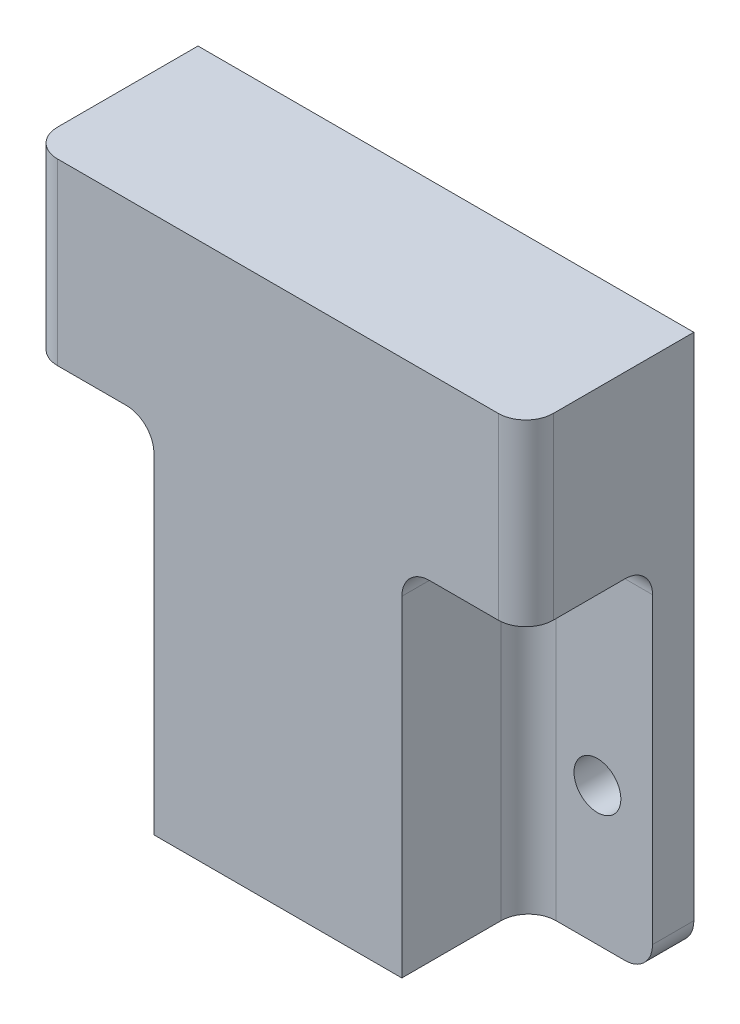
ISO-10303-21;
HEADER;
FILE_DESCRIPTION(('STEP AP214'),'2;1');
FILE_NAME('part.step','',(''),(''),'','','');
FILE_SCHEMA(('AUTOMOTIVE_DESIGN { 1 0 10303 214 1 1 1 1 }'));
ENDSEC;
DATA;
#1=APPLICATION_CONTEXT('core data for automotive mechanical design processes');
#2=APPLICATION_PROTOCOL_DEFINITION('international standard','automotive_design',2000,#1);
#3=PRODUCT_CONTEXT('',#1,'mechanical');
#4=PRODUCT('Part','Part','',(#3));
#5=PRODUCT_RELATED_PRODUCT_CATEGORY('part','',(#4));
#6=PRODUCT_DEFINITION_FORMATION('','',#4);
#7=PRODUCT_DEFINITION_CONTEXT('part definition',#1,'design');
#8=PRODUCT_DEFINITION('design','',#6,#7);
#9=PRODUCT_DEFINITION_SHAPE('','',#8);
#10=(LENGTH_UNIT() NAMED_UNIT(*) SI_UNIT(.MILLI.,.METRE.));
#11=(NAMED_UNIT(*) PLANE_ANGLE_UNIT() SI_UNIT($,.RADIAN.));
#12=(NAMED_UNIT(*) SI_UNIT($,.STERADIAN.) SOLID_ANGLE_UNIT());
#13=UNCERTAINTY_MEASURE_WITH_UNIT(LENGTH_MEASURE(1.E-05),#10,'distance_accuracy_value','');
#14=(GEOMETRIC_REPRESENTATION_CONTEXT(3) GLOBAL_UNCERTAINTY_ASSIGNED_CONTEXT((#13)) GLOBAL_UNIT_ASSIGNED_CONTEXT((#10,
#11,#12)) REPRESENTATION_CONTEXT('',''));
#15=CARTESIAN_POINT('',(0.,0.,0.));
#16=DIRECTION('',(0.,0.,1.));
#17=DIRECTION('',(1.,0.,0.));
#18=AXIS2_PLACEMENT_3D('',#15,#16,#17);
#19=CARTESIAN_POINT('',(0.,0.,3.));
#20=DIRECTION('',(0.,0.,1.));
#21=DIRECTION('',(1.,0.,0.));
#22=AXIS2_PLACEMENT_3D('',#19,#20,#21);
#23=PLANE('',#22);
#24=CARTESIAN_POINT('',(-14.,0.,3.));
#25=DIRECTION('',(0.,0.,1.));
#26=DIRECTION('',(1.,0.,0.));
#27=AXIS2_PLACEMENT_3D('',#24,#25,#26);
#28=CIRCLE('',#27,1.7);
#29=CARTESIAN_POINT('',(-12.3,0.,3.));
#30=VERTEX_POINT('',#29);
#31=EDGE_CURVE('E413',#30,#30,#28,.T.);
#32=ORIENTED_EDGE('',*,*,#31,.F.);
#33=EDGE_LOOP('',(#32));
#34=FACE_BOUND('',#33,.T.);
#35=DIRECTION('',(0.,-1.,0.));
#36=VECTOR('',#35,1.);
#37=CARTESIAN_POINT('',(-18.,0.,3.));
#38=LINE('',#37,#36);
#39=CARTESIAN_POINT('',(-18.,14.,3.));
#40=VERTEX_POINT('',#39);
#41=CARTESIAN_POINT('',(-18.,-8.,3.));
#42=VERTEX_POINT('',#41);
#43=EDGE_CURVE('E227',#40,#42,#38,.T.);
#44=ORIENTED_EDGE('',*,*,#43,.T.);
#45=CARTESIAN_POINT('',(-16.,-8.,3.));
#46=DIRECTION('',(0.,0.,1.));
#47=DIRECTION('',(1.,0.,0.));
#48=AXIS2_PLACEMENT_3D('',#45,#46,#47);
#49=CIRCLE('',#48,2.);
#50=CARTESIAN_POINT('',(-16.,-10.,3.));
#51=VERTEX_POINT('',#50);
#52=EDGE_CURVE('E11',#42,#51,#49,.T.);
#53=ORIENTED_EDGE('',*,*,#52,.T.);
#54=DIRECTION('',(-1.,0.,0.));
#55=VECTOR('',#54,1.);
#56=CARTESIAN_POINT('',(0.,-10.,3.));
#57=LINE('',#56,#55);
#58=CARTESIAN_POINT('',(-11.,-10.,3.));
#59=VERTEX_POINT('',#58);
#60=EDGE_CURVE('E391',#59,#51,#57,.T.);
#61=ORIENTED_EDGE('',*,*,#60,.F.);
#62=DIRECTION('',(0.,1.,0.));
#63=VECTOR('',#62,1.);
#64=CARTESIAN_POINT('',(-11.,16.,3.));
#65=LINE('',#64,#63);
#66=CARTESIAN_POINT('',(-11.,14.,3.));
#67=VERTEX_POINT('',#66);
#68=EDGE_CURVE('E436',#59,#67,#65,.T.);
#69=ORIENTED_EDGE('',*,*,#68,.T.);
#70=DIRECTION('',(1.,0.,0.));
#71=VECTOR('',#70,1.);
#72=CARTESIAN_POINT('',(0.,14.,3.));
#73=LINE('',#72,#71);
#74=EDGE_CURVE('E434',#67,#40,#73,.F.);
#75=ORIENTED_EDGE('',*,*,#74,.T.);
#76=EDGE_LOOP('',(#44,#53,#61,#69,#75));
#77=FACE_BOUND('',#76,.T.);
#78=ADVANCED_FACE('F43',(#34,#77),#23,.T.);
#79=CARTESIAN_POINT('',(6.5,-10.,3.));
#80=VERTEX_POINT('',#79);
#81=CARTESIAN_POINT('',(-6.5,-10.,3.));
#82=VERTEX_POINT('',#81);
#83=EDGE_CURVE('E387',#80,#82,#57,.T.);
#84=ORIENTED_EDGE('',*,*,#83,.F.);
#85=DIRECTION('',(0.,1.,0.));
#86=VECTOR('',#85,1.);
#87=CARTESIAN_POINT('',(6.5,-12.8701204345569,3.));
#88=LINE('',#87,#86);
#89=CARTESIAN_POINT('',(6.50000000000001,16.,3.));
#90=VERTEX_POINT('',#89);
#91=EDGE_CURVE('E279',#80,#90,#88,.T.);
#92=ORIENTED_EDGE('',*,*,#91,.T.);
#93=DIRECTION('',(1.,0.,0.));
#94=VECTOR('',#93,1.);
#95=CARTESIAN_POINT('',(-18.,16.,3.));
#96=LINE('',#95,#94);
#97=CARTESIAN_POINT('',(-6.50000000000001,16.,3.));
#98=VERTEX_POINT('',#97);
#99=EDGE_CURVE('E355',#98,#90,#96,.T.);
#100=ORIENTED_EDGE('',*,*,#99,.F.);
#101=DIRECTION('',(0.,1.,0.));
#102=VECTOR('',#101,1.);
#103=CARTESIAN_POINT('',(-6.5,-12.8701204345569,3.));
#104=LINE('',#103,#102);
#105=EDGE_CURVE('E393',#82,#98,#104,.T.);
#106=ORIENTED_EDGE('',*,*,#105,.F.);
#107=EDGE_LOOP('',(#84,#92,#100,#106));
#108=FACE_BOUND('',#107,.T.);
#109=ADVANCED_FACE('F515',(#108),#23,.T.);
#110=CARTESIAN_POINT('',(-6.5,-12.8701204345569,3.));
#111=DIRECTION('',(1.,0.,0.));
#112=DIRECTION('',(0.,0.,-1.));
#113=AXIS2_PLACEMENT_3D('',#110,#111,#112);
#114=PLANE('',#113);
#115=ORIENTED_EDGE('',*,*,#105,.T.);
#116=DIRECTION('',(0.,0.,1.));
#117=VECTOR('',#116,1.);
#118=CARTESIAN_POINT('',(-6.50000000000001,16.,3.));
#119=LINE('',#118,#117);
#120=CARTESIAN_POINT('',(-6.5,16.,9.));
#121=VERTEX_POINT('',#120);
#122=EDGE_CURVE('E366',#98,#121,#119,.T.);
#123=ORIENTED_EDGE('',*,*,#122,.T.);
#124=DIRECTION('',(0.,1.,0.));
#125=VECTOR('',#124,1.);
#126=CARTESIAN_POINT('',(-6.5,-12.8701204345569,9.));
#127=LINE('',#126,#125);
#128=CARTESIAN_POINT('',(-6.5,-10.,9.));
#129=VERTEX_POINT('',#128);
#130=EDGE_CURVE('E397',#129,#121,#127,.T.);
#131=ORIENTED_EDGE('',*,*,#130,.F.);
#132=DIRECTION('',(0.,0.,-1.));
#133=VECTOR('',#132,1.);
#134=CARTESIAN_POINT('',(-6.5,-10.,3.));
#135=LINE('',#134,#133);
#136=EDGE_CURVE('E376',#129,#82,#135,.T.);
#137=ORIENTED_EDGE('',*,*,#136,.T.);
#138=EDGE_LOOP('',(#115,#123,#131,#137));
#139=FACE_BOUND('',#138,.T.);
#140=ADVANCED_FACE('F521',(#139),#114,.T.);
#141=CARTESIAN_POINT('',(-6.5,-12.8701204345569,9.));
#142=DIRECTION('',(0.,0.,-1.));
#143=DIRECTION('',(-1.,0.,0.));
#144=AXIS2_PLACEMENT_3D('',#141,#142,#143);
#145=PLANE('',#144);
#146=ORIENTED_EDGE('',*,*,#130,.T.);
#147=DIRECTION('',(1.,0.,0.));
#148=VECTOR('',#147,1.);
#149=CARTESIAN_POINT('',(-6.5,16.,9.));
#150=LINE('',#149,#148);
#151=CARTESIAN_POINT('',(6.5,16.,9.));
#152=VERTEX_POINT('',#151);
#153=EDGE_CURVE('E361',#121,#152,#150,.T.);
#154=ORIENTED_EDGE('',*,*,#153,.T.);
#155=DIRECTION('',(0.,1.,0.));
#156=VECTOR('',#155,1.);
#157=CARTESIAN_POINT('',(6.5,-12.8701204345569,9.));
#158=LINE('',#157,#156);
#159=CARTESIAN_POINT('',(6.5,-10.,9.));
#160=VERTEX_POINT('',#159);
#161=EDGE_CURVE('E283',#160,#152,#158,.T.);
#162=ORIENTED_EDGE('',*,*,#161,.F.);
#163=DIRECTION('',(-1.,0.,0.));
#164=VECTOR('',#163,1.);
#165=CARTESIAN_POINT('',(-6.5,-10.,9.));
#166=LINE('',#165,#164);
#167=EDGE_CURVE('E373',#160,#129,#166,.T.);
#168=ORIENTED_EDGE('',*,*,#167,.T.);
#169=EDGE_LOOP('',(#146,#154,#162,#168));
#170=FACE_BOUND('',#169,.T.);
#171=ADVANCED_FACE('F564',(#170),#145,.T.);
#172=CARTESIAN_POINT('',(-9.,-12.8701204345569,12.2));
#173=DIRECTION('',(-1.,0.,0.));
#174=DIRECTION('',(0.,-1.,0.));
#175=AXIS2_PLACEMENT_3D('',#172,#173,#174);
#176=PLANE('',#175);
#177=DIRECTION('',(0.,1.,0.));
#178=VECTOR('',#177,1.);
#179=CARTESIAN_POINT('',(-9.,-12.8701204345569,12.2));
#180=LINE('',#179,#178);
#181=CARTESIAN_POINT('',(-9.,-10.,12.2));
#182=VERTEX_POINT('',#181);
#183=CARTESIAN_POINT('',(-9.,14.,12.2));
#184=VERTEX_POINT('',#183);
#185=EDGE_CURVE('E390',#182,#184,#180,.T.);
#186=ORIENTED_EDGE('',*,*,#185,.T.);
#187=DIRECTION('',(0.,0.,-1.));
#188=VECTOR('',#187,1.);
#189=CARTESIAN_POINT('',(-9.,14.,12.2));
#190=LINE('',#189,#188);
#191=CARTESIAN_POINT('',(-9.,14.,5.));
#192=VERTEX_POINT('',#191);
#193=EDGE_CURVE('E421',#184,#192,#190,.T.);
#194=ORIENTED_EDGE('',*,*,#193,.T.);
#195=DIRECTION('',(0.,1.,0.));
#196=VECTOR('',#195,1.);
#197=CARTESIAN_POINT('',(-9.,-10.,5.));
#198=LINE('',#197,#196);
#199=CARTESIAN_POINT('',(-9.,-10.,5.));
#200=VERTEX_POINT('',#199);
#201=EDGE_CURVE('E418',#192,#200,#198,.F.);
#202=ORIENTED_EDGE('',*,*,#201,.T.);
#203=DIRECTION('',(0.,0.,1.));
#204=VECTOR('',#203,1.);
#205=CARTESIAN_POINT('',(-9.,-10.,12.2));
#206=LINE('',#205,#204);
#207=EDGE_CURVE('E369',#200,#182,#206,.T.);
#208=ORIENTED_EDGE('',*,*,#207,.T.);
#209=EDGE_LOOP('',(#186,#194,#202,#208));
#210=FACE_BOUND('',#209,.T.);
#211=ADVANCED_FACE('F489',(#210),#176,.T.);
#212=CARTESIAN_POINT('',(0.,0.,0.));
#213=DIRECTION('',(0.,0.,1.));
#214=DIRECTION('',(1.,0.,0.));
#215=AXIS2_PLACEMENT_3D('',#212,#213,#214);
#216=PLANE('',#215);
#217=CARTESIAN_POINT('',(16.,-8.,0.));
#218=DIRECTION('',(0.,0.,-1.));
#219=DIRECTION('',(-1.,0.,0.));
#220=AXIS2_PLACEMENT_3D('',#217,#218,#219);
#221=CIRCLE('',#220,2.);
#222=CARTESIAN_POINT('',(16.,-10.,0.));
#223=VERTEX_POINT('',#222);
#224=CARTESIAN_POINT('',(18.,-8.,0.));
#225=VERTEX_POINT('',#224);
#226=EDGE_CURVE('E346',#223,#225,#221,.F.);
#227=ORIENTED_EDGE('',*,*,#226,.F.);
#228=DIRECTION('',(-1.,0.,0.));
#229=VECTOR('',#228,1.);
#230=CARTESIAN_POINT('',(0.,-10.,0.));
#231=LINE('',#230,#229);
#232=CARTESIAN_POINT('',(-16.,-10.,0.));
#233=VERTEX_POINT('',#232);
#234=EDGE_CURVE('E386',#223,#233,#231,.T.);
#235=ORIENTED_EDGE('',*,*,#234,.T.);
#236=CARTESIAN_POINT('',(-16.,-8.,0.));
#237=DIRECTION('',(0.,0.,1.));
#238=DIRECTION('',(1.,0.,0.));
#239=AXIS2_PLACEMENT_3D('',#236,#237,#238);
#240=CIRCLE('',#239,2.);
#241=CARTESIAN_POINT('',(-18.,-8.,0.));
#242=VERTEX_POINT('',#241);
#243=EDGE_CURVE('E65',#233,#242,#240,.F.);
#244=ORIENTED_EDGE('',*,*,#243,.T.);
#245=DIRECTION('',(0.,-1.,0.));
#246=VECTOR('',#245,1.);
#247=CARTESIAN_POINT('',(-18.,0.,0.));
#248=LINE('',#247,#246);
#249=CARTESIAN_POINT('',(-18.,29.,0.));
#250=VERTEX_POINT('',#249);
#251=EDGE_CURVE('E219',#250,#242,#248,.T.);
#252=ORIENTED_EDGE('',*,*,#251,.F.);
#253=DIRECTION('',(-1.,0.,0.));
#254=VECTOR('',#253,1.);
#255=CARTESIAN_POINT('',(18.,29.,0.));
#256=LINE('',#255,#254);
#257=CARTESIAN_POINT('',(18.,29.,0.));
#258=VERTEX_POINT('',#257);
#259=EDGE_CURVE('E226',#258,#250,#256,.T.);
#260=ORIENTED_EDGE('',*,*,#259,.F.);
#261=DIRECTION('',(0.,-1.,0.));
#262=VECTOR('',#261,1.);
#263=CARTESIAN_POINT('',(18.,0.,0.));
#264=LINE('',#263,#262);
#265=EDGE_CURVE('E302',#258,#225,#264,.T.);
#266=ORIENTED_EDGE('',*,*,#265,.T.);
#267=EDGE_LOOP('',(#227,#235,#244,#252,#260,#266));
#268=FACE_BOUND('',#267,.T.);
#269=CARTESIAN_POINT('',(-14.,0.,0.));
#270=DIRECTION('',(0.,0.,1.));
#271=DIRECTION('',(1.,0.,0.));
#272=AXIS2_PLACEMENT_3D('',#269,#270,#271);
#273=CIRCLE('',#272,1.7);
#274=CARTESIAN_POINT('',(-12.3,0.,0.));
#275=VERTEX_POINT('',#274);
#276=EDGE_CURVE('E228',#275,#275,#273,.T.);
#277=ORIENTED_EDGE('',*,*,#276,.T.);
#278=EDGE_LOOP('',(#277));
#279=FACE_BOUND('',#278,.T.);
#280=DIRECTION('',(1.,0.,0.));
#281=VECTOR('',#280,1.);
#282=CARTESIAN_POINT('',(0.,-3.,0.));
#283=LINE('',#282,#281);
#284=CARTESIAN_POINT('',(-8.,-3.,0.));
#285=VERTEX_POINT('',#284);
#286=CARTESIAN_POINT('',(8.,-3.,0.));
#287=VERTEX_POINT('',#286);
#288=EDGE_CURVE('E379',#285,#287,#283,.T.);
#289=ORIENTED_EDGE('',*,*,#288,.T.);
#290=DIRECTION('',(0.,1.,0.));
#291=VECTOR('',#290,1.);
#292=CARTESIAN_POINT('',(8.,0.,0.));
#293=LINE('',#292,#291);
#294=CARTESIAN_POINT('',(8.,3.,0.));
#295=VERTEX_POINT('',#294);
#296=EDGE_CURVE('E282',#287,#295,#293,.T.);
#297=ORIENTED_EDGE('',*,*,#296,.T.);
#298=DIRECTION('',(1.,0.,0.));
#299=VECTOR('',#298,1.);
#300=CARTESIAN_POINT('',(0.,3.,0.));
#301=LINE('',#300,#299);
#302=CARTESIAN_POINT('',(-8.,3.,0.));
#303=VERTEX_POINT('',#302);
#304=EDGE_CURVE('E405',#303,#295,#301,.T.);
#305=ORIENTED_EDGE('',*,*,#304,.F.);
#306=DIRECTION('',(0.,1.,0.));
#307=VECTOR('',#306,1.);
#308=CARTESIAN_POINT('',(-8.,0.,0.));
#309=LINE('',#308,#307);
#310=EDGE_CURVE('E396',#285,#303,#309,.T.);
#311=ORIENTED_EDGE('',*,*,#310,.F.);
#312=EDGE_LOOP('',(#289,#297,#305,#311));
#313=FACE_BOUND('',#312,.T.);
#314=CARTESIAN_POINT('',(14.,0.,0.));
#315=DIRECTION('',(0.,0.,-1.));
#316=DIRECTION('',(-1.,0.,0.));
#317=AXIS2_PLACEMENT_3D('',#314,#315,#316);
#318=CIRCLE('',#317,1.7);
#319=CARTESIAN_POINT('',(12.3,0.,0.));
#320=VERTEX_POINT('',#319);
#321=EDGE_CURVE('E299',#320,#320,#318,.T.);
#322=ORIENTED_EDGE('',*,*,#321,.F.);
#323=EDGE_LOOP('',(#322));
#324=FACE_BOUND('',#323,.T.);
#325=ADVANCED_FACE('F222',(#268,#279,#313,#324),#216,.F.);
#326=CARTESIAN_POINT('',(-18.,0.,3.));
#327=DIRECTION('',(1.,0.,0.));
#328=DIRECTION('',(0.,0.,-1.));
#329=AXIS2_PLACEMENT_3D('',#326,#327,#328);
#330=PLANE('',#329);
#331=ORIENTED_EDGE('',*,*,#251,.T.);
#332=DIRECTION('',(0.,0.,-1.));
#333=VECTOR('',#332,1.);
#334=CARTESIAN_POINT('',(-18.,-8.,3.));
#335=LINE('',#334,#333);
#336=EDGE_CURVE('E51',#242,#42,#335,.F.);
#337=ORIENTED_EDGE('',*,*,#336,.T.);
#338=ORIENTED_EDGE('',*,*,#43,.F.);
#339=CARTESIAN_POINT('',(-18.,14.,5.));
#340=DIRECTION('',(1.,0.,0.));
#341=DIRECTION('',(0.,0.,-1.));
#342=AXIS2_PLACEMENT_3D('',#339,#340,#341);
#343=CIRCLE('',#342,2.);
#344=CARTESIAN_POINT('',(-18.,16.,5.));
#345=VERTEX_POINT('',#344);
#346=EDGE_CURVE('E442',#40,#345,#343,.T.);
#347=ORIENTED_EDGE('',*,*,#346,.T.);
#348=DIRECTION('',(0.,0.,-1.));
#349=VECTOR('',#348,1.);
#350=CARTESIAN_POINT('',(-18.,16.,30.4482875908947));
#351=LINE('',#350,#349);
#352=CARTESIAN_POINT('',(-18.,16.,10.2));
#353=VERTEX_POINT('',#352);
#354=EDGE_CURVE('E358',#353,#345,#351,.T.);
#355=ORIENTED_EDGE('',*,*,#354,.F.);
#356=DIRECTION('',(0.,-1.,0.));
#357=VECTOR('',#356,1.);
#358=CARTESIAN_POINT('',(-18.,19.,10.2));
#359=LINE('',#358,#357);
#360=CARTESIAN_POINT('',(-18.,29.,10.2));
#361=VERTEX_POINT('',#360);
#362=EDGE_CURVE('E235',#353,#361,#359,.F.);
#363=ORIENTED_EDGE('',*,*,#362,.T.);
#364=DIRECTION('',(0.,0.,1.));
#365=VECTOR('',#364,1.);
#366=CARTESIAN_POINT('',(-18.,29.,0.));
#367=LINE('',#366,#365);
#368=EDGE_CURVE('E231',#250,#361,#367,.T.);
#369=ORIENTED_EDGE('',*,*,#368,.F.);
#370=EDGE_LOOP('',(#331,#337,#338,#347,#355,#363,#369));
#371=FACE_BOUND('',#370,.T.);
#372=ADVANCED_FACE('F232',(#371),#330,.F.);
#373=CARTESIAN_POINT('',(-14.,0.,3.));
#374=DIRECTION('',(0.,0.,1.));
#375=DIRECTION('',(1.,0.,0.));
#376=AXIS2_PLACEMENT_3D('',#373,#374,#375);
#377=CYLINDRICAL_SURFACE('',#376,1.7);
#378=ORIENTED_EDGE('',*,*,#31,.T.);
#379=EDGE_LOOP('',(#378));
#380=FACE_BOUND('',#379,.T.);
#381=ORIENTED_EDGE('',*,*,#276,.F.);
#382=EDGE_LOOP('',(#381));
#383=FACE_BOUND('',#382,.T.);
#384=ADVANCED_FACE('F526',(#380,#383),#377,.F.);
#385=CARTESIAN_POINT('',(-8.,0.,-3.));
#386=DIRECTION('',(1.,0.,0.));
#387=DIRECTION('',(0.,0.,-1.));
#388=AXIS2_PLACEMENT_3D('',#385,#386,#387);
#389=PLANE('',#388);
#390=ORIENTED_EDGE('',*,*,#310,.T.);
#391=DIRECTION('',(0.,0.,1.));
#392=VECTOR('',#391,1.);
#393=CARTESIAN_POINT('',(-8.,3.,-3.));
#394=LINE('',#393,#392);
#395=CARTESIAN_POINT('',(-8.,3.,-3.));
#396=VERTEX_POINT('',#395);
#397=EDGE_CURVE('E407',#396,#303,#394,.T.);
#398=ORIENTED_EDGE('',*,*,#397,.F.);
#399=DIRECTION('',(0.,1.,0.));
#400=VECTOR('',#399,1.);
#401=CARTESIAN_POINT('',(-8.,0.,-3.));
#402=LINE('',#401,#400);
#403=CARTESIAN_POINT('',(-8.,-3.,-3.));
#404=VERTEX_POINT('',#403);
#405=EDGE_CURVE('E402',#404,#396,#402,.T.);
#406=ORIENTED_EDGE('',*,*,#405,.F.);
#407=DIRECTION('',(0.,0.,1.));
#408=VECTOR('',#407,1.);
#409=CARTESIAN_POINT('',(-8.,-3.,-3.));
#410=LINE('',#409,#408);
#411=EDGE_CURVE('E382',#404,#285,#410,.T.);
#412=ORIENTED_EDGE('',*,*,#411,.T.);
#413=EDGE_LOOP('',(#390,#398,#406,#412));
#414=FACE_BOUND('',#413,.T.);
#415=ADVANCED_FACE('F579',(#414),#389,.F.);
#416=CARTESIAN_POINT('',(0.,3.,-3.));
#417=DIRECTION('',(0.,-1.,0.));
#418=DIRECTION('',(0.,0.,-1.));
#419=AXIS2_PLACEMENT_3D('',#416,#417,#418);
#420=PLANE('',#419);
#421=ORIENTED_EDGE('',*,*,#304,.T.);
#422=DIRECTION('',(0.,0.,1.));
#423=VECTOR('',#422,1.);
#424=CARTESIAN_POINT('',(8.,3.,-3.));
#425=LINE('',#424,#423);
#426=CARTESIAN_POINT('',(8.,3.,-3.));
#427=VERTEX_POINT('',#426);
#428=EDGE_CURVE('E291',#427,#295,#425,.T.);
#429=ORIENTED_EDGE('',*,*,#428,.F.);
#430=DIRECTION('',(1.,0.,0.));
#431=VECTOR('',#430,1.);
#432=CARTESIAN_POINT('',(0.,3.,-3.));
#433=LINE('',#432,#431);
#434=EDGE_CURVE('E404',#396,#427,#433,.T.);
#435=ORIENTED_EDGE('',*,*,#434,.F.);
#436=ORIENTED_EDGE('',*,*,#397,.T.);
#437=EDGE_LOOP('',(#421,#429,#435,#436));
#438=FACE_BOUND('',#437,.T.);
#439=ADVANCED_FACE('F576',(#438),#420,.F.);
#440=CARTESIAN_POINT('',(0.,0.,-3.));
#441=DIRECTION('',(0.,0.,1.));
#442=DIRECTION('',(1.,0.,0.));
#443=AXIS2_PLACEMENT_3D('',#440,#441,#442);
#444=PLANE('',#443);
#445=ORIENTED_EDGE('',*,*,#434,.T.);
#446=DIRECTION('',(0.,1.,0.));
#447=VECTOR('',#446,1.);
#448=CARTESIAN_POINT('',(8.,0.,-3.));
#449=LINE('',#448,#447);
#450=CARTESIAN_POINT('',(8.,-3.,-3.));
#451=VERTEX_POINT('',#450);
#452=EDGE_CURVE('E288',#451,#427,#449,.T.);
#453=ORIENTED_EDGE('',*,*,#452,.F.);
#454=DIRECTION('',(1.,0.,0.));
#455=VECTOR('',#454,1.);
#456=CARTESIAN_POINT('',(0.,-3.,-3.));
#457=LINE('',#456,#455);
#458=EDGE_CURVE('E380',#404,#451,#457,.T.);
#459=ORIENTED_EDGE('',*,*,#458,.F.);
#460=ORIENTED_EDGE('',*,*,#405,.T.);
#461=EDGE_LOOP('',(#445,#453,#459,#460));
#462=FACE_BOUND('',#461,.T.);
#463=ADVANCED_FACE('F571',(#462),#444,.F.);
#464=CARTESIAN_POINT('',(0.,-12.8701204345569,12.2));
#465=DIRECTION('',(0.,0.,1.));
#466=DIRECTION('',(1.,0.,0.));
#467=AXIS2_PLACEMENT_3D('',#464,#465,#466);
#468=PLANE('',#467);
#469=DIRECTION('',(0.,-1.,0.));
#470=VECTOR('',#469,1.);
#471=CARTESIAN_POINT('',(16.,16.,12.2));
#472=LINE('',#471,#470);
#473=CARTESIAN_POINT('',(16.,29.,12.2));
#474=VERTEX_POINT('',#473);
#475=CARTESIAN_POINT('',(16.,16.,12.2));
#476=VERTEX_POINT('',#475);
#477=EDGE_CURVE('E320',#474,#476,#472,.T.);
#478=ORIENTED_EDGE('',*,*,#477,.F.);
#479=DIRECTION('',(1.,0.,0.));
#480=VECTOR('',#479,1.);
#481=CARTESIAN_POINT('',(-16.,29.,12.2));
#482=LINE('',#481,#480);
#483=CARTESIAN_POINT('',(-16.,29.,12.2));
#484=VERTEX_POINT('',#483);
#485=EDGE_CURVE('E249',#484,#474,#482,.T.);
#486=ORIENTED_EDGE('',*,*,#485,.F.);
#487=DIRECTION('',(0.,-1.,0.));
#488=VECTOR('',#487,1.);
#489=CARTESIAN_POINT('',(-16.,16.,12.2));
#490=LINE('',#489,#488);
#491=CARTESIAN_POINT('',(-16.,16.,12.2));
#492=VERTEX_POINT('',#491);
#493=EDGE_CURVE('E430',#484,#492,#490,.T.);
#494=ORIENTED_EDGE('',*,*,#493,.T.);
#495=DIRECTION('',(1.,0.,0.));
#496=VECTOR('',#495,1.);
#497=CARTESIAN_POINT('',(-18.,16.,12.2));
#498=LINE('',#497,#496);
#499=CARTESIAN_POINT('',(-11.,16.,12.2));
#500=VERTEX_POINT('',#499);
#501=EDGE_CURVE('E357',#492,#500,#498,.T.);
#502=ORIENTED_EDGE('',*,*,#501,.T.);
#503=CARTESIAN_POINT('',(-11.,14.,12.2));
#504=DIRECTION('',(0.,0.,1.));
#505=DIRECTION('',(1.,0.,0.));
#506=AXIS2_PLACEMENT_3D('',#503,#504,#505);
#507=CIRCLE('',#506,2.);
#508=EDGE_CURVE('E438',#500,#184,#507,.F.);
#509=ORIENTED_EDGE('',*,*,#508,.T.);
#510=ORIENTED_EDGE('',*,*,#185,.F.);
#511=DIRECTION('',(1.,0.,0.));
#512=VECTOR('',#511,1.);
#513=CARTESIAN_POINT('',(0.,-10.,12.2));
#514=LINE('',#513,#512);
#515=CARTESIAN_POINT('',(9.,-10.,12.2));
#516=VERTEX_POINT('',#515);
#517=EDGE_CURVE('E371',#182,#516,#514,.T.);
#518=ORIENTED_EDGE('',*,*,#517,.T.);
#519=DIRECTION('',(0.,1.,0.));
#520=VECTOR('',#519,1.);
#521=CARTESIAN_POINT('',(9.,-12.8701204345569,12.2));
#522=LINE('',#521,#520);
#523=CARTESIAN_POINT('',(9.,14.,12.2));
#524=VERTEX_POINT('',#523);
#525=EDGE_CURVE('E278',#516,#524,#522,.T.);
#526=ORIENTED_EDGE('',*,*,#525,.T.);
#527=CARTESIAN_POINT('',(11.,14.,12.2));
#528=DIRECTION('',(0.,0.,-1.));
#529=DIRECTION('',(-1.,0.,0.));
#530=AXIS2_PLACEMENT_3D('',#527,#528,#529);
#531=CIRCLE('',#530,2.);
#532=CARTESIAN_POINT('',(11.,16.,12.2));
#533=VERTEX_POINT('',#532);
#534=EDGE_CURVE('E331',#533,#524,#531,.F.);
#535=ORIENTED_EDGE('',*,*,#534,.F.);
#536=DIRECTION('',(-1.,0.,0.));
#537=VECTOR('',#536,1.);
#538=CARTESIAN_POINT('',(18.,16.,12.2));
#539=LINE('',#538,#537);
#540=EDGE_CURVE('E256',#476,#533,#539,.T.);
#541=ORIENTED_EDGE('',*,*,#540,.F.);
#542=EDGE_LOOP('',(#478,#486,#494,#502,#509,#510,#518,#526,#535,#541));
#543=FACE_BOUND('',#542,.T.);
#544=ADVANCED_FACE('F484',(#543),#468,.T.);
#545=CARTESIAN_POINT('',(0.,-10.,3.));
#546=DIRECTION('',(0.,1.,0.));
#547=DIRECTION('',(0.,0.,-1.));
#548=AXIS2_PLACEMENT_3D('',#545,#546,#547);
#549=PLANE('',#548);
#550=ORIENTED_EDGE('',*,*,#234,.F.);
#551=DIRECTION('',(0.,0.,-1.));
#552=VECTOR('',#551,1.);
#553=CARTESIAN_POINT('',(16.,-10.,3.));
#554=LINE('',#553,#552);
#555=CARTESIAN_POINT('',(16.,-10.,3.));
#556=VERTEX_POINT('',#555);
#557=EDGE_CURVE('E338',#556,#223,#554,.T.);
#558=ORIENTED_EDGE('',*,*,#557,.F.);
#559=DIRECTION('',(1.,0.,0.));
#560=VECTOR('',#559,1.);
#561=CARTESIAN_POINT('',(0.,-10.,3.));
#562=LINE('',#561,#560);
#563=CARTESIAN_POINT('',(11.,-10.,3.));
#564=VERTEX_POINT('',#563);
#565=EDGE_CURVE('E275',#564,#556,#562,.T.);
#566=ORIENTED_EDGE('',*,*,#565,.F.);
#567=CARTESIAN_POINT('',(11.,-10.,5.));
#568=DIRECTION('',(0.,-1.,0.));
#569=DIRECTION('',(1.,0.,0.));
#570=AXIS2_PLACEMENT_3D('',#567,#568,#569);
#571=CIRCLE('',#570,2.);
#572=CARTESIAN_POINT('',(9.,-10.,5.));
#573=VERTEX_POINT('',#572);
#574=EDGE_CURVE('E333',#573,#564,#571,.T.);
#575=ORIENTED_EDGE('',*,*,#574,.F.);
#576=DIRECTION('',(0.,0.,1.));
#577=VECTOR('',#576,1.);
#578=CARTESIAN_POINT('',(9.,-10.,12.2));
#579=LINE('',#578,#577);
#580=EDGE_CURVE('E266',#573,#516,#579,.T.);
#581=ORIENTED_EDGE('',*,*,#580,.T.);
#582=ORIENTED_EDGE('',*,*,#517,.F.);
#583=ORIENTED_EDGE('',*,*,#207,.F.);
#584=CARTESIAN_POINT('',(-11.,-10.,5.));
#585=DIRECTION('',(0.,1.,0.));
#586=DIRECTION('',(-1.,0.,0.));
#587=AXIS2_PLACEMENT_3D('',#584,#585,#586);
#588=CIRCLE('',#587,2.);
#589=EDGE_CURVE('E440',#200,#59,#588,.T.);
#590=ORIENTED_EDGE('',*,*,#589,.T.);
#591=ORIENTED_EDGE('',*,*,#60,.T.);
#592=DIRECTION('',(0.,0.,-1.));
#593=VECTOR('',#592,1.);
#594=CARTESIAN_POINT('',(-16.,-10.,3.));
#595=LINE('',#594,#593);
#596=EDGE_CURVE('E444',#51,#233,#595,.T.);
#597=ORIENTED_EDGE('',*,*,#596,.T.);
#598=EDGE_LOOP('',(#550,#558,#566,#575,#581,#582,#583,#590,#591,#597));
#599=FACE_BOUND('',#598,.T.);
#600=DIRECTION('',(0.,0.,-1.));
#601=VECTOR('',#600,1.);
#602=CARTESIAN_POINT('',(6.5,-10.,3.));
#603=LINE('',#602,#601);
#604=EDGE_CURVE('E269',#160,#80,#603,.T.);
#605=ORIENTED_EDGE('',*,*,#604,.T.);
#606=ORIENTED_EDGE('',*,*,#83,.T.);
#607=ORIENTED_EDGE('',*,*,#136,.F.);
#608=ORIENTED_EDGE('',*,*,#167,.F.);
#609=EDGE_LOOP('',(#605,#606,#607,#608));
#610=FACE_BOUND('',#609,.T.);
#611=ADVANCED_FACE('F456',(#599,#610),#549,.F.);
#612=CARTESIAN_POINT('',(0.,-3.,-3.));
#613=DIRECTION('',(0.,1.,0.));
#614=DIRECTION('',(0.,0.,-1.));
#615=AXIS2_PLACEMENT_3D('',#612,#613,#614);
#616=PLANE('',#615);
#617=ORIENTED_EDGE('',*,*,#288,.F.);
#618=ORIENTED_EDGE('',*,*,#411,.F.);
#619=ORIENTED_EDGE('',*,*,#458,.T.);
#620=DIRECTION('',(0.,0.,1.));
#621=VECTOR('',#620,1.);
#622=CARTESIAN_POINT('',(8.,-3.,-3.));
#623=LINE('',#622,#621);
#624=EDGE_CURVE('E272',#451,#287,#623,.T.);
#625=ORIENTED_EDGE('',*,*,#624,.T.);
#626=EDGE_LOOP('',(#617,#618,#619,#625));
#627=FACE_BOUND('',#626,.T.);
#628=ADVANCED_FACE('F551',(#627),#616,.F.);
#629=CARTESIAN_POINT('',(-18.,16.,30.4482875908947));
#630=DIRECTION('',(0.,1.,0.));
#631=DIRECTION('',(-1.,0.,0.));
#632=AXIS2_PLACEMENT_3D('',#629,#630,#631);
#633=PLANE('',#632);
#634=ORIENTED_EDGE('',*,*,#122,.F.);
#635=ORIENTED_EDGE('',*,*,#99,.T.);
#636=DIRECTION('',(0.,0.,1.));
#637=VECTOR('',#636,1.);
#638=CARTESIAN_POINT('',(6.50000000000001,16.,3.));
#639=LINE('',#638,#637);
#640=EDGE_CURVE('E259',#90,#152,#639,.T.);
#641=ORIENTED_EDGE('',*,*,#640,.T.);
#642=ORIENTED_EDGE('',*,*,#153,.F.);
#643=EDGE_LOOP('',(#634,#635,#641,#642));
#644=FACE_BOUND('',#643,.T.);
#645=ADVANCED_FACE('F545',(#644),#633,.F.);
#646=ORIENTED_EDGE('',*,*,#501,.F.);
#647=CARTESIAN_POINT('',(-16.,16.,10.2));
#648=DIRECTION('',(0.,1.,0.));
#649=DIRECTION('',(-1.,0.,0.));
#650=AXIS2_PLACEMENT_3D('',#647,#648,#649);
#651=CIRCLE('',#650,2.);
#652=EDGE_CURVE('E428',#492,#353,#651,.F.);
#653=ORIENTED_EDGE('',*,*,#652,.T.);
#654=ORIENTED_EDGE('',*,*,#354,.T.);
#655=DIRECTION('',(1.,0.,0.));
#656=VECTOR('',#655,1.);
#657=CARTESIAN_POINT('',(-18.,16.,5.));
#658=LINE('',#657,#656);
#659=CARTESIAN_POINT('',(-11.,16.,5.));
#660=VERTEX_POINT('',#659);
#661=EDGE_CURVE('E424',#345,#660,#658,.T.);
#662=ORIENTED_EDGE('',*,*,#661,.T.);
#663=DIRECTION('',(0.,0.,-1.));
#664=VECTOR('',#663,1.);
#665=CARTESIAN_POINT('',(-11.,16.,30.4482875908947));
#666=LINE('',#665,#664);
#667=EDGE_CURVE('E426',#660,#500,#666,.F.);
#668=ORIENTED_EDGE('',*,*,#667,.T.);
#669=EDGE_LOOP('',(#646,#653,#654,#662,#668));
#670=FACE_BOUND('',#669,.T.);
#671=ADVANCED_FACE('F541',(#670),#633,.F.);
#672=CARTESIAN_POINT('',(-11.,0.,5.));
#673=DIRECTION('',(0.,-1.,0.));
#674=DIRECTION('',(1.,0.,0.));
#675=AXIS2_PLACEMENT_3D('',#672,#673,#674);
#676=CYLINDRICAL_SURFACE('',#675,2.);
#677=ORIENTED_EDGE('',*,*,#589,.F.);
#678=ORIENTED_EDGE('',*,*,#201,.F.);
#679=CARTESIAN_POINT('',(-11.,14.,5.));
#680=DIRECTION('',(0.,-1.,0.));
#681=DIRECTION('',(0.,0.,-1.));
#682=AXIS2_PLACEMENT_3D('',#679,#680,#681);
#683=CIRCLE('',#682,2.);
#684=EDGE_CURVE('E364',#67,#192,#683,.T.);
#685=ORIENTED_EDGE('',*,*,#684,.F.);
#686=ORIENTED_EDGE('',*,*,#68,.F.);
#687=EDGE_LOOP('',(#677,#678,#685,#686));
#688=FACE_BOUND('',#687,.T.);
#689=ADVANCED_FACE('F501',(#688),#676,.F.);
#690=CARTESIAN_POINT('',(-18.,14.,5.));
#691=DIRECTION('',(1.,0.,0.));
#692=DIRECTION('',(0.,1.,0.));
#693=AXIS2_PLACEMENT_3D('',#690,#691,#692);
#694=CYLINDRICAL_SURFACE('',#693,2.);
#695=ORIENTED_EDGE('',*,*,#346,.F.);
#696=ORIENTED_EDGE('',*,*,#74,.F.);
#697=CARTESIAN_POINT('',(-11.,14.,5.));
#698=DIRECTION('',(-1.,0.,0.));
#699=DIRECTION('',(0.,0.,1.));
#700=AXIS2_PLACEMENT_3D('',#697,#698,#699);
#701=CIRCLE('',#700,2.);
#702=EDGE_CURVE('E446',#660,#67,#701,.T.);
#703=ORIENTED_EDGE('',*,*,#702,.F.);
#704=ORIENTED_EDGE('',*,*,#661,.F.);
#705=EDGE_LOOP('',(#695,#696,#703,#704));
#706=FACE_BOUND('',#705,.T.);
#707=ADVANCED_FACE('F536',(#706),#694,.F.);
#708=CARTESIAN_POINT('',(-11.,14.,5.));
#709=DIRECTION('',(0.,0.,1.));
#710=DIRECTION('',(1.,0.,0.));
#711=AXIS2_PLACEMENT_3D('',#708,#709,#710);
#712=SPHERICAL_SURFACE('',#711,2.);
#713=ORIENTED_EDGE('',*,*,#702,.T.);
#714=ORIENTED_EDGE('',*,*,#684,.T.);
#715=CARTESIAN_POINT('',(-11.,14.,5.));
#716=DIRECTION('',(0.,0.,1.));
#717=DIRECTION('',(0.,-1.,0.));
#718=AXIS2_PLACEMENT_3D('',#715,#716,#717);
#719=CIRCLE('',#718,2.);
#720=EDGE_CURVE('E354',#660,#192,#719,.F.);
#721=ORIENTED_EDGE('',*,*,#720,.F.);
#722=EDGE_LOOP('',(#713,#714,#721));
#723=FACE_BOUND('',#722,.T.);
#724=ADVANCED_FACE('F497',(#723),#712,.F.);
#725=CARTESIAN_POINT('',(-11.,14.,12.2));
#726=DIRECTION('',(0.,0.,-1.));
#727=DIRECTION('',(-1.,0.,0.));
#728=AXIS2_PLACEMENT_3D('',#725,#726,#727);
#729=CYLINDRICAL_SURFACE('',#728,2.);
#730=ORIENTED_EDGE('',*,*,#508,.F.);
#731=ORIENTED_EDGE('',*,*,#667,.F.);
#732=ORIENTED_EDGE('',*,*,#720,.T.);
#733=ORIENTED_EDGE('',*,*,#193,.F.);
#734=EDGE_LOOP('',(#730,#731,#732,#733));
#735=FACE_BOUND('',#734,.T.);
#736=ADVANCED_FACE('F491',(#735),#729,.F.);
#737=CARTESIAN_POINT('',(-16.,-12.8701204345569,10.2));
#738=DIRECTION('',(0.,1.,0.));
#739=DIRECTION('',(0.,0.,1.));
#740=AXIS2_PLACEMENT_3D('',#737,#738,#739);
#741=CYLINDRICAL_SURFACE('',#740,2.);
#742=ORIENTED_EDGE('',*,*,#493,.F.);
#743=CARTESIAN_POINT('',(-16.,29.,10.2));
#744=DIRECTION('',(0.,1.,0.));
#745=DIRECTION('',(0.,0.,1.));
#746=AXIS2_PLACEMENT_3D('',#743,#744,#745);
#747=CIRCLE('',#746,2.);
#748=EDGE_CURVE('E239',#361,#484,#747,.T.);
#749=ORIENTED_EDGE('',*,*,#748,.F.);
#750=ORIENTED_EDGE('',*,*,#362,.F.);
#751=ORIENTED_EDGE('',*,*,#652,.F.);
#752=EDGE_LOOP('',(#742,#749,#750,#751));
#753=FACE_BOUND('',#752,.T.);
#754=ADVANCED_FACE('F505',(#753),#741,.T.);
#755=CARTESIAN_POINT('',(-16.,-8.,3.));
#756=DIRECTION('',(0.,0.,-1.));
#757=DIRECTION('',(-1.,0.,0.));
#758=AXIS2_PLACEMENT_3D('',#755,#756,#757);
#759=CYLINDRICAL_SURFACE('',#758,2.);
#760=ORIENTED_EDGE('',*,*,#52,.F.);
#761=ORIENTED_EDGE('',*,*,#336,.F.);
#762=ORIENTED_EDGE('',*,*,#243,.F.);
#763=ORIENTED_EDGE('',*,*,#596,.F.);
#764=EDGE_LOOP('',(#760,#761,#762,#763));
#765=FACE_BOUND('',#764,.T.);
#766=ADVANCED_FACE('F45',(#765),#759,.T.);
#767=CARTESIAN_POINT('',(0.,0.,3.));
#768=DIRECTION('',(0.,0.,1.));
#769=DIRECTION('',(-1.,0.,0.));
#770=AXIS2_PLACEMENT_3D('',#767,#768,#769);
#771=PLANE('',#770);
#772=CARTESIAN_POINT('',(14.,0.,3.));
#773=DIRECTION('',(0.,0.,-1.));
#774=DIRECTION('',(-1.,0.,0.));
#775=AXIS2_PLACEMENT_3D('',#772,#773,#774);
#776=CIRCLE('',#775,1.7);
#777=CARTESIAN_POINT('',(12.3,0.,3.));
#778=VERTEX_POINT('',#777);
#779=EDGE_CURVE('E296',#778,#778,#776,.T.);
#780=ORIENTED_EDGE('',*,*,#779,.T.);
#781=EDGE_LOOP('',(#780));
#782=FACE_BOUND('',#781,.T.);
#783=DIRECTION('',(0.,-1.,0.));
#784=VECTOR('',#783,1.);
#785=CARTESIAN_POINT('',(18.,0.,3.));
#786=LINE('',#785,#784);
#787=CARTESIAN_POINT('',(18.,14.,3.));
#788=VERTEX_POINT('',#787);
#789=CARTESIAN_POINT('',(18.,-8.,3.));
#790=VERTEX_POINT('',#789);
#791=EDGE_CURVE('E303',#788,#790,#786,.T.);
#792=ORIENTED_EDGE('',*,*,#791,.F.);
#793=DIRECTION('',(-1.,0.,0.));
#794=VECTOR('',#793,1.);
#795=CARTESIAN_POINT('',(0.,14.,3.));
#796=LINE('',#795,#794);
#797=CARTESIAN_POINT('',(11.,14.,3.));
#798=VERTEX_POINT('',#797);
#799=EDGE_CURVE('E325',#798,#788,#796,.F.);
#800=ORIENTED_EDGE('',*,*,#799,.F.);
#801=DIRECTION('',(0.,1.,0.));
#802=VECTOR('',#801,1.);
#803=CARTESIAN_POINT('',(11.,16.,3.));
#804=LINE('',#803,#802);
#805=EDGE_CURVE('E328',#564,#798,#804,.T.);
#806=ORIENTED_EDGE('',*,*,#805,.F.);
#807=ORIENTED_EDGE('',*,*,#565,.T.);
#808=CARTESIAN_POINT('',(16.,-8.,3.));
#809=DIRECTION('',(0.,0.,-1.));
#810=DIRECTION('',(-1.,0.,0.));
#811=AXIS2_PLACEMENT_3D('',#808,#809,#810);
#812=CIRCLE('',#811,2.);
#813=EDGE_CURVE('E351',#790,#556,#812,.T.);
#814=ORIENTED_EDGE('',*,*,#813,.F.);
#815=EDGE_LOOP('',(#792,#800,#806,#807,#814));
#816=FACE_BOUND('',#815,.T.);
#817=ADVANCED_FACE('F469',(#782,#816),#771,.T.);
#818=CARTESIAN_POINT('',(6.5,-12.8701204345569,3.));
#819=DIRECTION('',(-1.,0.,0.));
#820=DIRECTION('',(0.,0.,-1.));
#821=AXIS2_PLACEMENT_3D('',#818,#819,#820);
#822=PLANE('',#821);
#823=ORIENTED_EDGE('',*,*,#91,.F.);
#824=ORIENTED_EDGE('',*,*,#604,.F.);
#825=ORIENTED_EDGE('',*,*,#161,.T.);
#826=ORIENTED_EDGE('',*,*,#640,.F.);
#827=EDGE_LOOP('',(#823,#824,#825,#826));
#828=FACE_BOUND('',#827,.T.);
#829=ADVANCED_FACE('F510',(#828),#822,.T.);
#830=CARTESIAN_POINT('',(9.,-12.8701204345569,12.2));
#831=DIRECTION('',(1.,0.,0.));
#832=DIRECTION('',(0.,-1.,0.));
#833=AXIS2_PLACEMENT_3D('',#830,#831,#832);
#834=PLANE('',#833);
#835=ORIENTED_EDGE('',*,*,#525,.F.);
#836=ORIENTED_EDGE('',*,*,#580,.F.);
#837=DIRECTION('',(0.,1.,0.));
#838=VECTOR('',#837,1.);
#839=CARTESIAN_POINT('',(9.,-10.,5.));
#840=LINE('',#839,#838);
#841=CARTESIAN_POINT('',(9.,14.,5.));
#842=VERTEX_POINT('',#841);
#843=EDGE_CURVE('E306',#842,#573,#840,.F.);
#844=ORIENTED_EDGE('',*,*,#843,.F.);
#845=DIRECTION('',(0.,0.,-1.));
#846=VECTOR('',#845,1.);
#847=CARTESIAN_POINT('',(9.,14.,12.2));
#848=LINE('',#847,#846);
#849=EDGE_CURVE('E310',#524,#842,#848,.T.);
#850=ORIENTED_EDGE('',*,*,#849,.F.);
#851=EDGE_LOOP('',(#835,#836,#844,#850));
#852=FACE_BOUND('',#851,.T.);
#853=ADVANCED_FACE('F478',(#852),#834,.T.);
#854=CARTESIAN_POINT('',(18.,0.,3.));
#855=DIRECTION('',(-1.,0.,0.));
#856=DIRECTION('',(0.,0.,-1.));
#857=AXIS2_PLACEMENT_3D('',#854,#855,#856);
#858=PLANE('',#857);
#859=ORIENTED_EDGE('',*,*,#265,.F.);
#860=DIRECTION('',(0.,0.,-1.));
#861=VECTOR('',#860,1.);
#862=CARTESIAN_POINT('',(18.,29.,10.2));
#863=LINE('',#862,#861);
#864=CARTESIAN_POINT('',(18.,29.,10.2));
#865=VERTEX_POINT('',#864);
#866=EDGE_CURVE('E245',#865,#258,#863,.T.);
#867=ORIENTED_EDGE('',*,*,#866,.F.);
#868=DIRECTION('',(0.,-1.,0.));
#869=VECTOR('',#868,1.);
#870=CARTESIAN_POINT('',(18.,19.,10.2));
#871=LINE('',#870,#869);
#872=CARTESIAN_POINT('',(18.,16.,10.2));
#873=VERTEX_POINT('',#872);
#874=EDGE_CURVE('E323',#873,#865,#871,.F.);
#875=ORIENTED_EDGE('',*,*,#874,.F.);
#876=DIRECTION('',(0.,0.,-1.));
#877=VECTOR('',#876,1.);
#878=CARTESIAN_POINT('',(18.,16.,30.4482875908947));
#879=LINE('',#878,#877);
#880=CARTESIAN_POINT('',(18.,16.,5.));
#881=VERTEX_POINT('',#880);
#882=EDGE_CURVE('E260',#873,#881,#879,.T.);
#883=ORIENTED_EDGE('',*,*,#882,.T.);
#884=CARTESIAN_POINT('',(18.,14.,5.));
#885=DIRECTION('',(1.,0.,0.));
#886=DIRECTION('',(0.,0.,-1.));
#887=AXIS2_PLACEMENT_3D('',#884,#885,#886);
#888=CIRCLE('',#887,2.);
#889=EDGE_CURVE('E335',#788,#881,#888,.T.);
#890=ORIENTED_EDGE('',*,*,#889,.F.);
#891=ORIENTED_EDGE('',*,*,#791,.T.);
#892=DIRECTION('',(0.,0.,-1.));
#893=VECTOR('',#892,1.);
#894=CARTESIAN_POINT('',(18.,-8.,3.));
#895=LINE('',#894,#893);
#896=EDGE_CURVE('E349',#225,#790,#895,.F.);
#897=ORIENTED_EDGE('',*,*,#896,.F.);
#898=EDGE_LOOP('',(#859,#867,#875,#883,#890,#891,#897));
#899=FACE_BOUND('',#898,.T.);
#900=ADVANCED_FACE('F610',(#899),#858,.F.);
#901=CARTESIAN_POINT('',(14.,0.,3.));
#902=DIRECTION('',(0.,0.,1.));
#903=DIRECTION('',(-1.,0.,0.));
#904=AXIS2_PLACEMENT_3D('',#901,#902,#903);
#905=CYLINDRICAL_SURFACE('',#904,1.7);
#906=ORIENTED_EDGE('',*,*,#779,.F.);
#907=EDGE_LOOP('',(#906));
#908=FACE_BOUND('',#907,.T.);
#909=ORIENTED_EDGE('',*,*,#321,.T.);
#910=EDGE_LOOP('',(#909));
#911=FACE_BOUND('',#910,.T.);
#912=ADVANCED_FACE('F602',(#908,#911),#905,.F.);
#913=CARTESIAN_POINT('',(8.,0.,-3.));
#914=DIRECTION('',(-1.,0.,0.));
#915=DIRECTION('',(0.,0.,-1.));
#916=AXIS2_PLACEMENT_3D('',#913,#914,#915);
#917=PLANE('',#916);
#918=ORIENTED_EDGE('',*,*,#296,.F.);
#919=ORIENTED_EDGE('',*,*,#624,.F.);
#920=ORIENTED_EDGE('',*,*,#452,.T.);
#921=ORIENTED_EDGE('',*,*,#428,.T.);
#922=EDGE_LOOP('',(#918,#919,#920,#921));
#923=FACE_BOUND('',#922,.T.);
#924=ADVANCED_FACE('F599',(#923),#917,.F.);
#925=CARTESIAN_POINT('',(18.,16.,30.4482875908947));
#926=DIRECTION('',(0.,1.,0.));
#927=DIRECTION('',(1.,0.,0.));
#928=AXIS2_PLACEMENT_3D('',#925,#926,#927);
#929=PLANE('',#928);
#930=ORIENTED_EDGE('',*,*,#540,.T.);
#931=DIRECTION('',(0.,0.,-1.));
#932=VECTOR('',#931,1.);
#933=CARTESIAN_POINT('',(11.,16.,30.4482875908947));
#934=LINE('',#933,#932);
#935=CARTESIAN_POINT('',(11.,16.,5.));
#936=VERTEX_POINT('',#935);
#937=EDGE_CURVE('E316',#936,#533,#934,.F.);
#938=ORIENTED_EDGE('',*,*,#937,.F.);
#939=DIRECTION('',(-1.,0.,0.));
#940=VECTOR('',#939,1.);
#941=CARTESIAN_POINT('',(18.,16.,5.));
#942=LINE('',#941,#940);
#943=EDGE_CURVE('E313',#881,#936,#942,.T.);
#944=ORIENTED_EDGE('',*,*,#943,.F.);
#945=ORIENTED_EDGE('',*,*,#882,.F.);
#946=CARTESIAN_POINT('',(16.,16.,10.2));
#947=DIRECTION('',(0.,-1.,0.));
#948=DIRECTION('',(1.,0.,0.));
#949=AXIS2_PLACEMENT_3D('',#946,#947,#948);
#950=CIRCLE('',#949,2.);
#951=EDGE_CURVE('E318',#476,#873,#950,.F.);
#952=ORIENTED_EDGE('',*,*,#951,.F.);
#953=EDGE_LOOP('',(#930,#938,#944,#945,#952));
#954=FACE_BOUND('',#953,.T.);
#955=ADVANCED_FACE('F601',(#954),#929,.F.);
#956=CARTESIAN_POINT('',(11.,0.,5.));
#957=DIRECTION('',(0.,-1.,0.));
#958=DIRECTION('',(-1.,0.,0.));
#959=AXIS2_PLACEMENT_3D('',#956,#957,#958);
#960=CYLINDRICAL_SURFACE('',#959,2.);
#961=ORIENTED_EDGE('',*,*,#574,.T.);
#962=ORIENTED_EDGE('',*,*,#805,.T.);
#963=CARTESIAN_POINT('',(11.,14.,5.));
#964=DIRECTION('',(0.,1.,0.));
#965=DIRECTION('',(0.,0.,-1.));
#966=AXIS2_PLACEMENT_3D('',#963,#964,#965);
#967=CIRCLE('',#966,2.);
#968=EDGE_CURVE('E263',#798,#842,#967,.T.);
#969=ORIENTED_EDGE('',*,*,#968,.T.);
#970=ORIENTED_EDGE('',*,*,#843,.T.);
#971=EDGE_LOOP('',(#961,#962,#969,#970));
#972=FACE_BOUND('',#971,.T.);
#973=ADVANCED_FACE('F471',(#972),#960,.F.);
#974=CARTESIAN_POINT('',(18.,14.,5.));
#975=DIRECTION('',(-1.,0.,0.));
#976=DIRECTION('',(0.,1.,0.));
#977=AXIS2_PLACEMENT_3D('',#974,#975,#976);
#978=CYLINDRICAL_SURFACE('',#977,2.);
#979=ORIENTED_EDGE('',*,*,#889,.T.);
#980=ORIENTED_EDGE('',*,*,#943,.T.);
#981=CARTESIAN_POINT('',(11.,14.,5.));
#982=DIRECTION('',(-1.,0.,0.));
#983=DIRECTION('',(0.,0.,1.));
#984=AXIS2_PLACEMENT_3D('',#981,#982,#983);
#985=CIRCLE('',#984,2.);
#986=EDGE_CURVE('E340',#936,#798,#985,.T.);
#987=ORIENTED_EDGE('',*,*,#986,.T.);
#988=ORIENTED_EDGE('',*,*,#799,.T.);
#989=EDGE_LOOP('',(#979,#980,#987,#988));
#990=FACE_BOUND('',#989,.T.);
#991=ADVANCED_FACE('F627',(#990),#978,.F.);
#992=CARTESIAN_POINT('',(11.,14.,5.));
#993=DIRECTION('',(0.,0.,1.));
#994=DIRECTION('',(-1.,0.,0.));
#995=AXIS2_PLACEMENT_3D('',#992,#993,#994);
#996=SPHERICAL_SURFACE('',#995,2.);
#997=ORIENTED_EDGE('',*,*,#986,.F.);
#998=CARTESIAN_POINT('',(11.,14.,5.));
#999=DIRECTION('',(0.,0.,-1.));
#1000=DIRECTION('',(0.,-1.,0.));
#1001=AXIS2_PLACEMENT_3D('',#998,#999,#1000);
#1002=CIRCLE('',#1001,2.);
#1003=EDGE_CURVE('E255',#936,#842,#1002,.F.);
#1004=ORIENTED_EDGE('',*,*,#1003,.T.);
#1005=ORIENTED_EDGE('',*,*,#968,.F.);
#1006=EDGE_LOOP('',(#997,#1004,#1005));
#1007=FACE_BOUND('',#1006,.T.);
#1008=ADVANCED_FACE('F623',(#1007),#996,.F.);
#1009=CARTESIAN_POINT('',(11.,14.,12.2));
#1010=DIRECTION('',(0.,0.,-1.));
#1011=DIRECTION('',(1.,0.,0.));
#1012=AXIS2_PLACEMENT_3D('',#1009,#1010,#1011);
#1013=CYLINDRICAL_SURFACE('',#1012,2.);
#1014=ORIENTED_EDGE('',*,*,#534,.T.);
#1015=ORIENTED_EDGE('',*,*,#849,.T.);
#1016=ORIENTED_EDGE('',*,*,#1003,.F.);
#1017=ORIENTED_EDGE('',*,*,#937,.T.);
#1018=EDGE_LOOP('',(#1014,#1015,#1016,#1017));
#1019=FACE_BOUND('',#1018,.T.);
#1020=ADVANCED_FACE('F619',(#1019),#1013,.F.);
#1021=CARTESIAN_POINT('',(16.,-12.8701204345569,10.2));
#1022=DIRECTION('',(0.,1.,0.));
#1023=DIRECTION('',(0.,0.,1.));
#1024=AXIS2_PLACEMENT_3D('',#1021,#1022,#1023);
#1025=CYLINDRICAL_SURFACE('',#1024,2.);
#1026=ORIENTED_EDGE('',*,*,#874,.T.);
#1027=CARTESIAN_POINT('',(16.,29.,10.2));
#1028=DIRECTION('',(0.,1.,0.));
#1029=DIRECTION('',(0.,0.,1.));
#1030=AXIS2_PLACEMENT_3D('',#1027,#1028,#1029);
#1031=CIRCLE('',#1030,2.);
#1032=EDGE_CURVE('E252',#474,#865,#1031,.T.);
#1033=ORIENTED_EDGE('',*,*,#1032,.F.);
#1034=ORIENTED_EDGE('',*,*,#477,.T.);
#1035=ORIENTED_EDGE('',*,*,#951,.T.);
#1036=EDGE_LOOP('',(#1026,#1033,#1034,#1035));
#1037=FACE_BOUND('',#1036,.T.);
#1038=ADVANCED_FACE('F622',(#1037),#1025,.T.);
#1039=CARTESIAN_POINT('',(16.,-8.,3.));
#1040=DIRECTION('',(0.,0.,-1.));
#1041=DIRECTION('',(1.,0.,0.));
#1042=AXIS2_PLACEMENT_3D('',#1039,#1040,#1041);
#1043=CYLINDRICAL_SURFACE('',#1042,2.);
#1044=ORIENTED_EDGE('',*,*,#813,.T.);
#1045=ORIENTED_EDGE('',*,*,#557,.T.);
#1046=ORIENTED_EDGE('',*,*,#226,.T.);
#1047=ORIENTED_EDGE('',*,*,#896,.T.);
#1048=EDGE_LOOP('',(#1044,#1045,#1046,#1047));
#1049=FACE_BOUND('',#1048,.T.);
#1050=ADVANCED_FACE('F462',(#1049),#1043,.T.);
#1051=CARTESIAN_POINT('',(-16.,29.,10.2));
#1052=DIRECTION('',(0.,1.,0.));
#1053=DIRECTION('',(0.,0.,1.));
#1054=AXIS2_PLACEMENT_3D('',#1051,#1052,#1053);
#1055=PLANE('',#1054);
#1056=ORIENTED_EDGE('',*,*,#259,.T.);
#1057=ORIENTED_EDGE('',*,*,#368,.T.);
#1058=ORIENTED_EDGE('',*,*,#748,.T.);
#1059=ORIENTED_EDGE('',*,*,#485,.T.);
#1060=ORIENTED_EDGE('',*,*,#1032,.T.);
#1061=ORIENTED_EDGE('',*,*,#866,.T.);
#1062=EDGE_LOOP('',(#1056,#1057,#1058,#1059,#1060,#1061));
#1063=FACE_BOUND('',#1062,.T.);
#1064=ADVANCED_FACE('F242',(#1063),#1055,.T.);
#1065=CLOSED_SHELL('',(#78,#109,#140,#171,#211,#325,#372,#384,#415,#439,#463,#544,#611,#628,
#645,#671,#689,#707,#724,#736,#754,#766,#817,#829,#853,#900,#912,#924,#955,#973,#991,#1008,
#1020,#1038,#1050,#1064));
#1066=MANIFOLD_SOLID_BREP('B2',#1065);
#1067=ADVANCED_BREP_SHAPE_REPRESENTATION('',(#18,#1066),#14);
#1068=SHAPE_DEFINITION_REPRESENTATION(#9,#1067);
ENDSEC;
END-ISO-10303-21;
